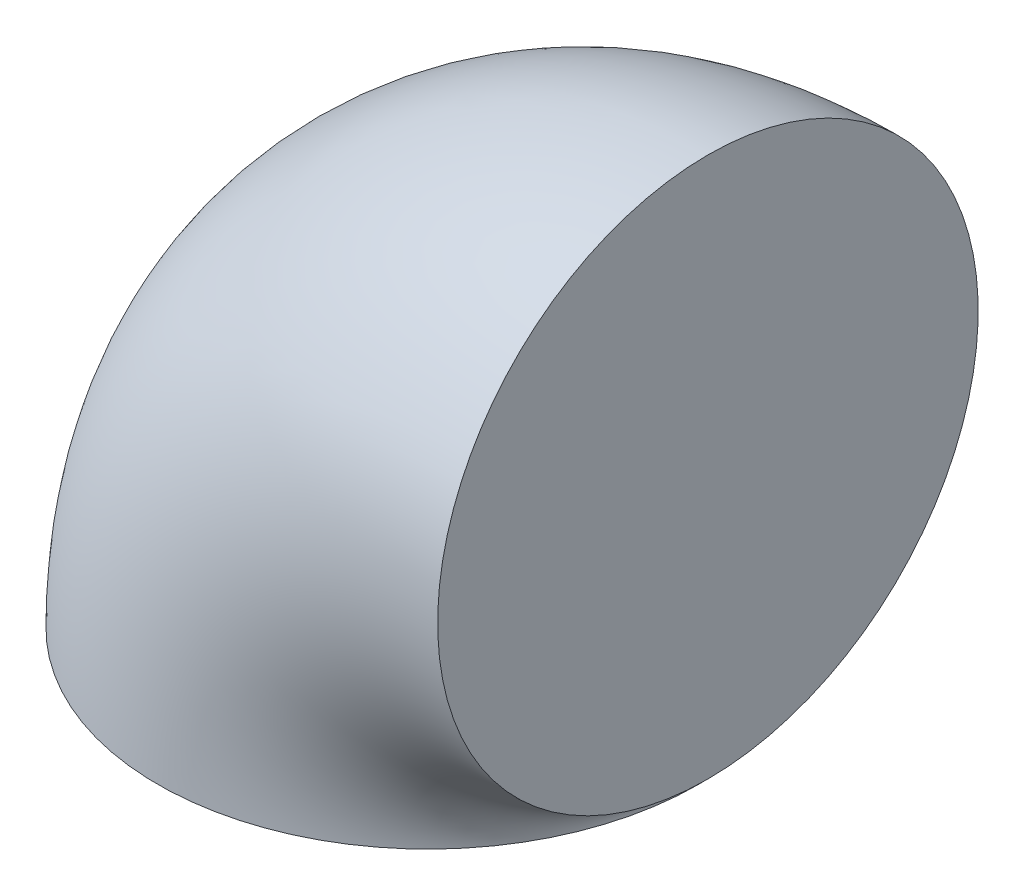
ISO-10303-21;
HEADER;
FILE_DESCRIPTION(('STEP AP214'),'2;1');
FILE_NAME('part.step','',(''),(''),'','','');
FILE_SCHEMA(('AUTOMOTIVE_DESIGN { 1 0 10303 214 1 1 1 1 }'));
ENDSEC;
DATA;
#1=APPLICATION_CONTEXT('core data for automotive mechanical design processes');
#2=APPLICATION_PROTOCOL_DEFINITION('international standard','automotive_design',2000,#1);
#3=PRODUCT_CONTEXT('',#1,'mechanical');
#4=PRODUCT('Part','Part','',(#3));
#5=PRODUCT_RELATED_PRODUCT_CATEGORY('part','',(#4));
#6=PRODUCT_DEFINITION_FORMATION('','',#4);
#7=PRODUCT_DEFINITION_CONTEXT('part definition',#1,'design');
#8=PRODUCT_DEFINITION('design','',#6,#7);
#9=PRODUCT_DEFINITION_SHAPE('','',#8);
#10=(LENGTH_UNIT() NAMED_UNIT(*) SI_UNIT(.MILLI.,.METRE.));
#11=(NAMED_UNIT(*) PLANE_ANGLE_UNIT() SI_UNIT($,.RADIAN.));
#12=(NAMED_UNIT(*) SI_UNIT($,.STERADIAN.) SOLID_ANGLE_UNIT());
#13=UNCERTAINTY_MEASURE_WITH_UNIT(LENGTH_MEASURE(1.E-05),#10,'distance_accuracy_value','');
#14=(GEOMETRIC_REPRESENTATION_CONTEXT(3) GLOBAL_UNCERTAINTY_ASSIGNED_CONTEXT((#13)) GLOBAL_UNIT_ASSIGNED_CONTEXT((#10,
#11,#12)) REPRESENTATION_CONTEXT('',''));
#15=CARTESIAN_POINT('',(0.,0.,0.));
#16=DIRECTION('',(0.,0.,1.));
#17=DIRECTION('',(1.,0.,0.));
#18=AXIS2_PLACEMENT_3D('',#15,#16,#17);
#19=CARTESIAN_POINT('',(64.7,0.,0.));
#20=DIRECTION('',(0.,0.,1.));
#21=DIRECTION('',(1.,0.,0.));
#22=AXIS2_PLACEMENT_3D('',#19,#20,#21);
#23=TOROIDAL_SURFACE('',#22,64.7,62.5);
#24=CARTESIAN_POINT('',(64.7000000000002,64.7,0.));
#25=DIRECTION('',(1.,0.,0.));
#26=DIRECTION('',(0.,0.,1.));
#27=AXIS2_PLACEMENT_3D('',#24,#25,#26);
#28=CIRCLE('',#27,62.5);
#29=CARTESIAN_POINT('',(64.7000000000005,127.2,0.));
#30=VERTEX_POINT('',#29);
#31=EDGE_CURVE('E10',#30,#30,#28,.T.);
#32=CARTESIAN_POINT('',(0.,0.,0.));
#33=DIRECTION('',(0.,1.,0.));
#34=DIRECTION('',(0.,0.,1.));
#35=AXIS2_PLACEMENT_3D('',#32,#33,#34);
#36=CIRCLE('',#35,62.5);
#37=CARTESIAN_POINT('',(-62.5,0.,0.));
#38=VERTEX_POINT('',#37);
#39=EDGE_CURVE('E46',#38,#38,#36,.T.);
#40=CARTESIAN_POINT('',(64.7,0.,0.));
#41=DIRECTION('',(0.,0.,1.));
#42=DIRECTION('',(1.,0.,0.));
#43=AXIS2_PLACEMENT_3D('',#40,#41,#42);
#44=CIRCLE('',#43,127.2);
#45=EDGE_CURVE('',#30,#38,#44,.T.);
#46=ORIENTED_EDGE('',*,*,#31,.F.);
#47=ORIENTED_EDGE('',*,*,#39,.T.);
#48=ORIENTED_EDGE('',*,*,#45,.T.);
#49=ORIENTED_EDGE('',*,*,#45,.F.);
#50=EDGE_LOOP('',(#46,#48,#47,#49));
#51=FACE_BOUND('',#50,.T.);
#52=ADVANCED_FACE('F39',(#51),#23,.T.);
#53=CARTESIAN_POINT('',(64.7000000000002,64.7,0.));
#54=DIRECTION('',(1.,0.,0.));
#55=DIRECTION('',(0.,0.,1.));
#56=AXIS2_PLACEMENT_3D('',#53,#54,#55);
#57=PLANE('',#56);
#58=ORIENTED_EDGE('',*,*,#31,.T.);
#59=EDGE_LOOP('',(#58));
#60=FACE_BOUND('',#59,.T.);
#61=ADVANCED_FACE('F56',(#60),#57,.T.);
#62=CARTESIAN_POINT('',(0.,0.,0.));
#63=DIRECTION('',(0.,1.,0.));
#64=DIRECTION('',(0.,0.,1.));
#65=AXIS2_PLACEMENT_3D('',#62,#63,#64);
#66=PLANE('',#65);
#67=ORIENTED_EDGE('',*,*,#39,.F.);
#68=EDGE_LOOP('',(#67));
#69=FACE_BOUND('',#68,.T.);
#70=ADVANCED_FACE('F54',(#69),#66,.F.);
#71=CLOSED_SHELL('',(#52,#61,#70));
#72=MANIFOLD_SOLID_BREP('B2',#71);
#73=ADVANCED_BREP_SHAPE_REPRESENTATION('',(#18,#72),#14);
#74=SHAPE_DEFINITION_REPRESENTATION(#9,#73);
ENDSEC;
END-ISO-10303-21;
